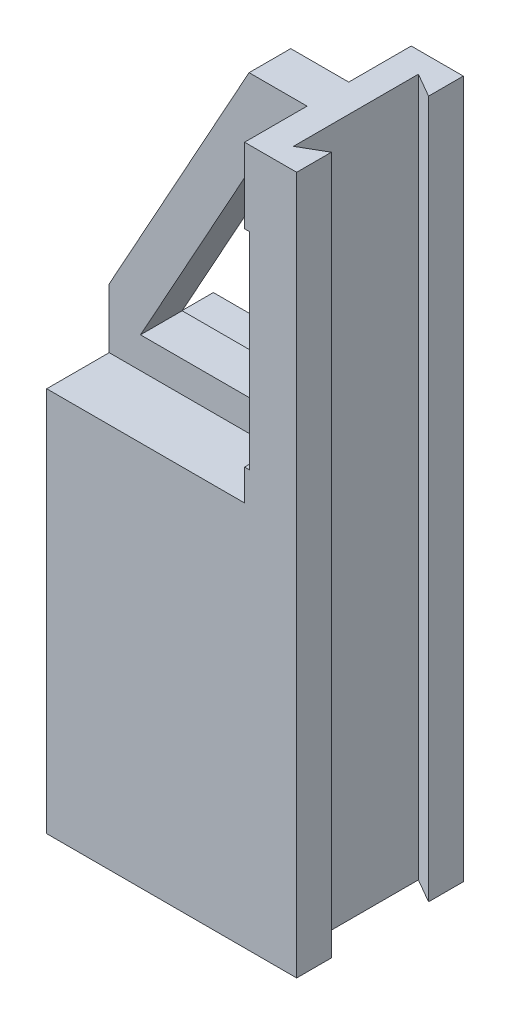
ISO-10303-21;
HEADER;
FILE_DESCRIPTION(('STEP AP214'),'2;1');
FILE_NAME('part.step','',(''),(''),'','','');
FILE_SCHEMA(('AUTOMOTIVE_DESIGN { 1 0 10303 214 1 1 1 1 }'));
ENDSEC;
DATA;
#1=APPLICATION_CONTEXT('core data for automotive mechanical design processes');
#2=APPLICATION_PROTOCOL_DEFINITION('international standard','automotive_design',2000,#1);
#3=PRODUCT_CONTEXT('',#1,'mechanical');
#4=PRODUCT('Part','Part','',(#3));
#5=PRODUCT_RELATED_PRODUCT_CATEGORY('part','',(#4));
#6=PRODUCT_DEFINITION_FORMATION('','',#4);
#7=PRODUCT_DEFINITION_CONTEXT('part definition',#1,'design');
#8=PRODUCT_DEFINITION('design','',#6,#7);
#9=PRODUCT_DEFINITION_SHAPE('','',#8);
#10=(LENGTH_UNIT() NAMED_UNIT(*) SI_UNIT(.MILLI.,.METRE.));
#11=(NAMED_UNIT(*) PLANE_ANGLE_UNIT() SI_UNIT($,.RADIAN.));
#12=(NAMED_UNIT(*) SI_UNIT($,.STERADIAN.) SOLID_ANGLE_UNIT());
#13=UNCERTAINTY_MEASURE_WITH_UNIT(LENGTH_MEASURE(1.E-05),#10,'distance_accuracy_value','');
#14=(GEOMETRIC_REPRESENTATION_CONTEXT(3) GLOBAL_UNCERTAINTY_ASSIGNED_CONTEXT((#13)) GLOBAL_UNIT_ASSIGNED_CONTEXT((#10,
#11,#12)) REPRESENTATION_CONTEXT('',''));
#15=CARTESIAN_POINT('',(0.,0.,0.));
#16=DIRECTION('',(0.,0.,1.));
#17=DIRECTION('',(1.,0.,0.));
#18=AXIS2_PLACEMENT_3D('',#15,#16,#17);
#19=CARTESIAN_POINT('',(120.,0.,80.));
#20=DIRECTION('',(-1.,0.,0.));
#21=DIRECTION('',(0.,0.,1.));
#22=AXIS2_PLACEMENT_3D('',#19,#20,#21);
#23=PLANE('',#22);
#24=DIRECTION('',(0.,0.,-1.));
#25=VECTOR('',#24,1.);
#26=CARTESIAN_POINT('',(120.,335.,80.));
#27=LINE('',#26,#25);
#28=CARTESIAN_POINT('',(120.,335.,16.6730460901802));
#29=VERTEX_POINT('',#28);
#30=CARTESIAN_POINT('',(120.,335.,0.));
#31=VERTEX_POINT('',#30);
#32=EDGE_CURVE('E342',#29,#31,#27,.T.);
#33=ORIENTED_EDGE('',*,*,#32,.F.);
#34=DIRECTION('',(0.,1.,0.));
#35=VECTOR('',#34,1.);
#36=CARTESIAN_POINT('',(120.,0.,16.6730460901802));
#37=LINE('',#36,#35);
#38=CARTESIAN_POINT('',(120.,0.,16.6730460901802));
#39=VERTEX_POINT('',#38);
#40=EDGE_CURVE('E218',#39,#29,#37,.T.);
#41=ORIENTED_EDGE('',*,*,#40,.F.);
#42=DIRECTION('',(0.,0.,-1.));
#43=VECTOR('',#42,1.);
#44=CARTESIAN_POINT('',(120.,0.,80.));
#45=LINE('',#44,#43);
#46=CARTESIAN_POINT('',(120.,0.,0.));
#47=VERTEX_POINT('',#46);
#48=EDGE_CURVE('E209',#39,#47,#45,.T.);
#49=ORIENTED_EDGE('',*,*,#48,.T.);
#50=DIRECTION('',(0.,1.,0.));
#51=VECTOR('',#50,1.);
#52=CARTESIAN_POINT('',(120.,0.,0.));
#53=LINE('',#52,#51);
#54=EDGE_CURVE('E332',#47,#31,#53,.T.);
#55=ORIENTED_EDGE('',*,*,#54,.T.);
#56=EDGE_LOOP('',(#33,#41,#49,#55));
#57=FACE_BOUND('',#56,.T.);
#58=ADVANCED_FACE('F35',(#57),#23,.F.);
#59=CARTESIAN_POINT('',(0.,0.,80.));
#60=DIRECTION('',(0.,0.,1.));
#61=DIRECTION('',(1.,0.,0.));
#62=AXIS2_PLACEMENT_3D('',#59,#60,#61);
#63=PLANE('',#62);
#64=DIRECTION('',(0.,1.,0.));
#65=VECTOR('',#64,1.);
#66=CARTESIAN_POINT('',(95.0000000000001,185.,80.));
#67=LINE('',#66,#65);
#68=CARTESIAN_POINT('',(95.0000000000001,298.978426920679,80.));
#69=VERTEX_POINT('',#68);
#70=CARTESIAN_POINT('',(95.,335.,80.));
#71=VERTEX_POINT('',#70);
#72=EDGE_CURVE('E272',#69,#71,#67,.T.);
#73=ORIENTED_EDGE('',*,*,#72,.F.);
#74=DIRECTION('',(-1.,0.,0.));
#75=VECTOR('',#74,1.);
#76=CARTESIAN_POINT('',(69.8251570739534,298.978426920679,80.));
#77=LINE('',#76,#75);
#78=CARTESIAN_POINT('',(97.3994917302005,298.978426920679,80.));
#79=VERTEX_POINT('',#78);
#80=EDGE_CURVE('E297',#79,#69,#77,.T.);
#81=ORIENTED_EDGE('',*,*,#80,.F.);
#82=DIRECTION('',(0.,1.,0.));
#83=VECTOR('',#82,1.);
#84=CARTESIAN_POINT('',(97.3994917302005,298.978426920679,80.));
#85=LINE('',#84,#83);
#86=CARTESIAN_POINT('',(97.3994917302006,199.934070046657,80.));
#87=VERTEX_POINT('',#86);
#88=EDGE_CURVE('E294',#87,#79,#85,.T.);
#89=ORIENTED_EDGE('',*,*,#88,.F.);
#90=DIRECTION('',(1.,0.,0.));
#91=VECTOR('',#90,1.);
#92=CARTESIAN_POINT('',(97.3994917302006,199.934070046657,80.));
#93=LINE('',#92,#91);
#94=CARTESIAN_POINT('',(95.0000000000001,199.934070046657,80.));
#95=VERTEX_POINT('',#94);
#96=EDGE_CURVE('E292',#95,#87,#93,.T.);
#97=ORIENTED_EDGE('',*,*,#96,.F.);
#98=CARTESIAN_POINT('',(95.0000000000001,185.,80.));
#99=VERTEX_POINT('',#98);
#100=EDGE_CURVE('E270',#99,#95,#67,.T.);
#101=ORIENTED_EDGE('',*,*,#100,.F.);
#102=DIRECTION('',(1.,0.,0.));
#103=VECTOR('',#102,1.);
#104=CARTESIAN_POINT('',(1.02039165649137E-13,185.,80.));
#105=LINE('',#104,#103);
#106=CARTESIAN_POINT('',(1.02039165649137E-13,185.,80.));
#107=VERTEX_POINT('',#106);
#108=EDGE_CURVE('E259',#107,#99,#105,.T.);
#109=ORIENTED_EDGE('',*,*,#108,.F.);
#110=DIRECTION('',(0.,-1.,0.));
#111=VECTOR('',#110,1.);
#112=CARTESIAN_POINT('',(0.,213.595360649971,80.));
#113=LINE('',#112,#111);
#114=CARTESIAN_POINT('',(0.,0.,80.));
#115=VERTEX_POINT('',#114);
#116=EDGE_CURVE('E318',#107,#115,#113,.T.);
#117=ORIENTED_EDGE('',*,*,#116,.T.);
#118=DIRECTION('',(1.,0.,0.));
#119=VECTOR('',#118,1.);
#120=CARTESIAN_POINT('',(0.,0.,80.));
#121=LINE('',#120,#119);
#122=CARTESIAN_POINT('',(120.,0.,80.));
#123=VERTEX_POINT('',#122);
#124=EDGE_CURVE('E320',#115,#123,#121,.T.);
#125=ORIENTED_EDGE('',*,*,#124,.T.);
#126=DIRECTION('',(0.,1.,0.));
#127=VECTOR('',#126,1.);
#128=CARTESIAN_POINT('',(120.,0.,80.));
#129=LINE('',#128,#127);
#130=CARTESIAN_POINT('',(120.,335.,80.));
#131=VERTEX_POINT('',#130);
#132=EDGE_CURVE('E323',#123,#131,#129,.T.);
#133=ORIENTED_EDGE('',*,*,#132,.T.);
#134=DIRECTION('',(-1.,0.,0.));
#135=VECTOR('',#134,1.);
#136=CARTESIAN_POINT('',(120.,335.,80.));
#137=LINE('',#136,#135);
#138=EDGE_CURVE('E325',#131,#71,#137,.T.);
#139=ORIENTED_EDGE('',*,*,#138,.T.);
#140=EDGE_LOOP('',(#73,#81,#89,#97,#101,#109,#117,#125,#133,#139));
#141=FACE_BOUND('',#140,.T.);
#142=ADVANCED_FACE('F365',(#141),#63,.T.);
#143=CARTESIAN_POINT('',(0.,0.,0.));
#144=DIRECTION('',(0.,0.,1.));
#145=DIRECTION('',(1.,0.,0.));
#146=AXIS2_PLACEMENT_3D('',#143,#144,#145);
#147=PLANE('',#146);
#148=DIRECTION('',(-1.,0.,0.));
#149=VECTOR('',#148,1.);
#150=CARTESIAN_POINT('',(69.8251570739534,298.978426920679,0.));
#151=LINE('',#150,#149);
#152=CARTESIAN_POINT('',(97.3994917302005,298.978426920679,0.));
#153=VERTEX_POINT('',#152);
#154=CARTESIAN_POINT('',(95.0000000000001,298.978426920679,0.));
#155=VERTEX_POINT('',#154);
#156=EDGE_CURVE('E295',#153,#155,#151,.T.);
#157=ORIENTED_EDGE('',*,*,#156,.T.);
#158=DIRECTION('',(0.,1.,0.));
#159=VECTOR('',#158,1.);
#160=CARTESIAN_POINT('',(95.0000000000001,185.,0.));
#161=LINE('',#160,#159);
#162=CARTESIAN_POINT('',(95.,335.,0.));
#163=VERTEX_POINT('',#162);
#164=EDGE_CURVE('E247',#155,#163,#161,.T.);
#165=ORIENTED_EDGE('',*,*,#164,.T.);
#166=DIRECTION('',(-1.,0.,0.));
#167=VECTOR('',#166,1.);
#168=CARTESIAN_POINT('',(120.,335.,0.));
#169=LINE('',#168,#167);
#170=EDGE_CURVE('E321',#31,#163,#169,.T.);
#171=ORIENTED_EDGE('',*,*,#170,.F.);
#172=ORIENTED_EDGE('',*,*,#54,.F.);
#173=DIRECTION('',(1.,0.,0.));
#174=VECTOR('',#173,1.);
#175=CARTESIAN_POINT('',(0.,0.,0.));
#176=LINE('',#175,#174);
#177=CARTESIAN_POINT('',(0.,0.,0.));
#178=VERTEX_POINT('',#177);
#179=EDGE_CURVE('E330',#178,#47,#176,.T.);
#180=ORIENTED_EDGE('',*,*,#179,.F.);
#181=DIRECTION('',(0.,-1.,0.));
#182=VECTOR('',#181,1.);
#183=CARTESIAN_POINT('',(0.,213.595360649971,0.));
#184=LINE('',#183,#182);
#185=CARTESIAN_POINT('',(1.02039165649137E-13,185.,0.));
#186=VERTEX_POINT('',#185);
#187=EDGE_CURVE('E317',#186,#178,#184,.T.);
#188=ORIENTED_EDGE('',*,*,#187,.F.);
#189=DIRECTION('',(-1.,0.,0.));
#190=VECTOR('',#189,1.);
#191=CARTESIAN_POINT('',(1.02039165649137E-13,185.,0.));
#192=LINE('',#191,#190);
#193=CARTESIAN_POINT('',(95.0000000000001,185.,0.));
#194=VERTEX_POINT('',#193);
#195=EDGE_CURVE('E235',#194,#186,#192,.T.);
#196=ORIENTED_EDGE('',*,*,#195,.F.);
#197=CARTESIAN_POINT('',(95.0000000000001,199.934070046657,0.));
#198=VERTEX_POINT('',#197);
#199=EDGE_CURVE('E243',#194,#198,#161,.T.);
#200=ORIENTED_EDGE('',*,*,#199,.T.);
#201=DIRECTION('',(1.,0.,0.));
#202=VECTOR('',#201,1.);
#203=CARTESIAN_POINT('',(97.3994917302006,199.934070046657,0.));
#204=LINE('',#203,#202);
#205=CARTESIAN_POINT('',(97.3994917302006,199.934070046657,0.));
#206=VERTEX_POINT('',#205);
#207=EDGE_CURVE('E291',#198,#206,#204,.T.);
#208=ORIENTED_EDGE('',*,*,#207,.T.);
#209=DIRECTION('',(0.,1.,0.));
#210=VECTOR('',#209,1.);
#211=CARTESIAN_POINT('',(97.3994917302005,298.978426920679,0.));
#212=LINE('',#211,#210);
#213=EDGE_CURVE('E302',#206,#153,#212,.T.);
#214=ORIENTED_EDGE('',*,*,#213,.T.);
#215=EDGE_LOOP('',(#157,#165,#171,#172,#180,#188,#196,#200,#208,#214));
#216=FACE_BOUND('',#215,.T.);
#217=ADVANCED_FACE('F423',(#216),#147,.F.);
#218=CARTESIAN_POINT('',(0.,213.595360649971,80.));
#219=DIRECTION('',(1.,0.,0.));
#220=DIRECTION('',(0.,0.,-1.));
#221=AXIS2_PLACEMENT_3D('',#218,#219,#220);
#222=PLANE('',#221);
#223=DIRECTION('',(0.,0.,-1.));
#224=VECTOR('',#223,1.);
#225=CARTESIAN_POINT('',(0.,213.595360649971,80.));
#226=LINE('',#225,#224);
#227=CARTESIAN_POINT('',(0.,213.595360649971,50.));
#228=VERTEX_POINT('',#227);
#229=CARTESIAN_POINT('',(0.,213.595360649971,30.));
#230=VERTEX_POINT('',#229);
#231=EDGE_CURVE('E328',#228,#230,#226,.T.);
#232=ORIENTED_EDGE('',*,*,#231,.T.);
#233=DIRECTION('',(0.,1.,0.));
#234=VECTOR('',#233,1.);
#235=CARTESIAN_POINT('',(1.02057963836372E-13,185.,30.));
#236=LINE('',#235,#234);
#237=CARTESIAN_POINT('',(1.02057963836372E-13,185.,30.));
#238=VERTEX_POINT('',#237);
#239=EDGE_CURVE('E237',#238,#230,#236,.T.);
#240=ORIENTED_EDGE('',*,*,#239,.F.);
#241=DIRECTION('',(0.,0.,1.));
#242=VECTOR('',#241,1.);
#243=CARTESIAN_POINT('',(1.02057963836372E-13,185.,30.));
#244=LINE('',#243,#242);
#245=EDGE_CURVE('E225',#186,#238,#244,.T.);
#246=ORIENTED_EDGE('',*,*,#245,.F.);
#247=ORIENTED_EDGE('',*,*,#187,.T.);
#248=DIRECTION('',(0.,0.,-1.));
#249=VECTOR('',#248,1.);
#250=CARTESIAN_POINT('',(0.,0.,80.));
#251=LINE('',#250,#249);
#252=EDGE_CURVE('E349',#115,#178,#251,.T.);
#253=ORIENTED_EDGE('',*,*,#252,.F.);
#254=ORIENTED_EDGE('',*,*,#116,.F.);
#255=DIRECTION('',(0.,0.,1.));
#256=VECTOR('',#255,1.);
#257=CARTESIAN_POINT('',(1.02057963836372E-13,185.,50.));
#258=LINE('',#257,#256);
#259=CARTESIAN_POINT('',(1.02057963836372E-13,185.,50.));
#260=VERTEX_POINT('',#259);
#261=EDGE_CURVE('E256',#260,#107,#258,.T.);
#262=ORIENTED_EDGE('',*,*,#261,.F.);
#263=DIRECTION('',(0.,1.,0.));
#264=VECTOR('',#263,1.);
#265=CARTESIAN_POINT('',(1.02057963836372E-13,185.,50.));
#266=LINE('',#265,#264);
#267=EDGE_CURVE('E264',#260,#228,#266,.T.);
#268=ORIENTED_EDGE('',*,*,#267,.T.);
#269=EDGE_LOOP('',(#232,#240,#246,#247,#253,#254,#262,#268));
#270=FACE_BOUND('',#269,.T.);
#271=ADVANCED_FACE('F37',(#270),#222,.F.);
#272=CARTESIAN_POINT('',(0.,0.,80.));
#273=DIRECTION('',(0.,1.,0.));
#274=DIRECTION('',(0.,0.,1.));
#275=AXIS2_PLACEMENT_3D('',#272,#273,#274);
#276=PLANE('',#275);
#277=ORIENTED_EDGE('',*,*,#48,.F.);
#278=DIRECTION('',(-0.866025403784441,0.,-0.499999999999995));
#279=VECTOR('',#278,1.);
#280=CARTESIAN_POINT('',(120.,0.,16.6730460901802));
#281=LINE('',#280,#279);
#282=CARTESIAN_POINT('',(108.441945130559,0.,10.));
#283=VERTEX_POINT('',#282);
#284=EDGE_CURVE('E191',#39,#283,#281,.T.);
#285=ORIENTED_EDGE('',*,*,#284,.T.);
#286=DIRECTION('',(0.,0.,1.));
#287=VECTOR('',#286,1.);
#288=CARTESIAN_POINT('',(108.441945130559,0.,10.));
#289=LINE('',#288,#287);
#290=CARTESIAN_POINT('',(108.441945130559,0.,70.));
#291=VERTEX_POINT('',#290);
#292=EDGE_CURVE('E200',#283,#291,#289,.T.);
#293=ORIENTED_EDGE('',*,*,#292,.T.);
#294=DIRECTION('',(0.866025403784438,0.,-0.500000000000001));
#295=VECTOR('',#294,1.);
#296=CARTESIAN_POINT('',(108.441945130559,0.,70.));
#297=LINE('',#296,#295);
#298=CARTESIAN_POINT('',(120.,0.,63.3269539098197));
#299=VERTEX_POINT('',#298);
#300=EDGE_CURVE('E197',#291,#299,#297,.T.);
#301=ORIENTED_EDGE('',*,*,#300,.T.);
#302=EDGE_CURVE('E346',#123,#299,#45,.T.);
#303=ORIENTED_EDGE('',*,*,#302,.F.);
#304=ORIENTED_EDGE('',*,*,#124,.F.);
#305=ORIENTED_EDGE('',*,*,#252,.T.);
#306=ORIENTED_EDGE('',*,*,#179,.T.);
#307=EDGE_LOOP('',(#277,#285,#293,#301,#303,#304,#305,#306));
#308=FACE_BOUND('',#307,.T.);
#309=ADVANCED_FACE('F207',(#308),#276,.F.);
#310=ORIENTED_EDGE('',*,*,#302,.T.);
#311=DIRECTION('',(0.,1.,0.));
#312=VECTOR('',#311,1.);
#313=CARTESIAN_POINT('',(120.,0.,63.3269539098197));
#314=LINE('',#313,#312);
#315=CARTESIAN_POINT('',(120.,335.,63.3269539098197));
#316=VERTEX_POINT('',#315);
#317=EDGE_CURVE('E221',#299,#316,#314,.T.);
#318=ORIENTED_EDGE('',*,*,#317,.T.);
#319=EDGE_CURVE('E343',#131,#316,#27,.T.);
#320=ORIENTED_EDGE('',*,*,#319,.F.);
#321=ORIENTED_EDGE('',*,*,#132,.F.);
#322=EDGE_LOOP('',(#310,#318,#320,#321));
#323=FACE_BOUND('',#322,.T.);
#324=ADVANCED_FACE('F405',(#323),#23,.F.);
#325=CARTESIAN_POINT('',(120.,335.,80.));
#326=DIRECTION('',(0.,-1.,0.));
#327=DIRECTION('',(0.,0.,-1.));
#328=AXIS2_PLACEMENT_3D('',#325,#326,#327);
#329=PLANE('',#328);
#330=DIRECTION('',(0.,0.,1.));
#331=VECTOR('',#330,1.);
#332=CARTESIAN_POINT('',(108.441945130559,335.,10.));
#333=LINE('',#332,#331);
#334=CARTESIAN_POINT('',(108.441945130559,335.,9.99999999999999));
#335=VERTEX_POINT('',#334);
#336=CARTESIAN_POINT('',(108.441945130559,335.,70.));
#337=VERTEX_POINT('',#336);
#338=EDGE_CURVE('E212',#335,#337,#333,.T.);
#339=ORIENTED_EDGE('',*,*,#338,.F.);
#340=DIRECTION('',(-0.866025403784441,0.,-0.499999999999995));
#341=VECTOR('',#340,1.);
#342=CARTESIAN_POINT('',(120.,335.,16.6730460901802));
#343=LINE('',#342,#341);
#344=EDGE_CURVE('E50',#29,#335,#343,.T.);
#345=ORIENTED_EDGE('',*,*,#344,.F.);
#346=ORIENTED_EDGE('',*,*,#32,.T.);
#347=ORIENTED_EDGE('',*,*,#170,.T.);
#348=DIRECTION('',(0.,0.,-1.));
#349=VECTOR('',#348,1.);
#350=CARTESIAN_POINT('',(95.,335.,30.));
#351=LINE('',#350,#349);
#352=CARTESIAN_POINT('',(95.,335.,30.));
#353=VERTEX_POINT('',#352);
#354=EDGE_CURVE('E229',#353,#163,#351,.T.);
#355=ORIENTED_EDGE('',*,*,#354,.F.);
#356=DIRECTION('',(1.,0.,0.));
#357=VECTOR('',#356,1.);
#358=CARTESIAN_POINT('',(0.,335.,30.));
#359=LINE('',#358,#357);
#360=CARTESIAN_POINT('',(67.160475454182,335.,30.));
#361=VERTEX_POINT('',#360);
#362=EDGE_CURVE('E238',#361,#353,#359,.T.);
#363=ORIENTED_EDGE('',*,*,#362,.F.);
#364=DIRECTION('',(0.,0.,-1.));
#365=VECTOR('',#364,1.);
#366=CARTESIAN_POINT('',(67.160475454182,335.,80.));
#367=LINE('',#366,#365);
#368=CARTESIAN_POINT('',(67.160475454182,335.,50.));
#369=VERTEX_POINT('',#368);
#370=EDGE_CURVE('E339',#369,#361,#367,.T.);
#371=ORIENTED_EDGE('',*,*,#370,.F.);
#372=DIRECTION('',(-1.,0.,0.));
#373=VECTOR('',#372,1.);
#374=CARTESIAN_POINT('',(0.,335.,50.));
#375=LINE('',#374,#373);
#376=CARTESIAN_POINT('',(95.,335.,50.));
#377=VERTEX_POINT('',#376);
#378=EDGE_CURVE('E220',#377,#369,#375,.T.);
#379=ORIENTED_EDGE('',*,*,#378,.F.);
#380=DIRECTION('',(0.,0.,-1.));
#381=VECTOR('',#380,1.);
#382=CARTESIAN_POINT('',(95.,335.,50.));
#383=LINE('',#382,#381);
#384=EDGE_CURVE('E257',#71,#377,#383,.T.);
#385=ORIENTED_EDGE('',*,*,#384,.F.);
#386=ORIENTED_EDGE('',*,*,#138,.F.);
#387=ORIENTED_EDGE('',*,*,#319,.T.);
#388=DIRECTION('',(0.866025403784438,0.,-0.500000000000001));
#389=VECTOR('',#388,1.);
#390=CARTESIAN_POINT('',(108.441945130559,335.,70.));
#391=LINE('',#390,#389);
#392=EDGE_CURVE('E210',#337,#316,#391,.T.);
#393=ORIENTED_EDGE('',*,*,#392,.F.);
#394=EDGE_LOOP('',(#339,#345,#346,#347,#355,#363,#371,#379,#385,#386,#387,#393));
#395=FACE_BOUND('',#394,.T.);
#396=ADVANCED_FACE('F408',(#395),#329,.F.);
#397=CARTESIAN_POINT('',(67.160475454182,335.,80.));
#398=DIRECTION('',(0.875032631367901,-0.484063935902446,0.));
#399=DIRECTION('',(0.484063935902446,0.875032631367901,0.));
#400=AXIS2_PLACEMENT_3D('',#397,#398,#399);
#401=PLANE('',#400);
#402=ORIENTED_EDGE('',*,*,#370,.T.);
#403=DIRECTION('',(-0.484063935902446,-0.875032631367901,0.));
#404=VECTOR('',#403,1.);
#405=CARTESIAN_POINT('',(67.160475454182,335.,30.));
#406=LINE('',#405,#404);
#407=EDGE_CURVE('E284',#361,#230,#406,.T.);
#408=ORIENTED_EDGE('',*,*,#407,.T.);
#409=ORIENTED_EDGE('',*,*,#231,.F.);
#410=DIRECTION('',(0.484063935902446,0.875032631367901,0.));
#411=VECTOR('',#410,1.);
#412=CARTESIAN_POINT('',(67.160475454182,335.,50.));
#413=LINE('',#412,#411);
#414=EDGE_CURVE('E277',#228,#369,#413,.T.);
#415=ORIENTED_EDGE('',*,*,#414,.T.);
#416=EDGE_LOOP('',(#402,#408,#409,#415));
#417=FACE_BOUND('',#416,.T.);
#418=ADVANCED_FACE('F414',(#417),#401,.F.);
#419=CARTESIAN_POINT('',(97.3994917302006,199.934070046657,80.));
#420=DIRECTION('',(0.,1.,0.));
#421=DIRECTION('',(0.,0.,1.));
#422=AXIS2_PLACEMENT_3D('',#419,#420,#421);
#423=PLANE('',#422);
#424=DIRECTION('',(0.,0.,-1.));
#425=VECTOR('',#424,1.);
#426=CARTESIAN_POINT('',(95.0000000000001,199.934070046657,80.));
#427=LINE('',#426,#425);
#428=CARTESIAN_POINT('',(95.0000000000001,199.934070046657,30.));
#429=VERTEX_POINT('',#428);
#430=EDGE_CURVE('E289',#429,#198,#427,.T.);
#431=ORIENTED_EDGE('',*,*,#430,.F.);
#432=DIRECTION('',(1.,0.,0.));
#433=VECTOR('',#432,1.);
#434=CARTESIAN_POINT('',(97.3994917302006,199.934070046657,30.));
#435=LINE('',#434,#433);
#436=CARTESIAN_POINT('',(15.0342847125226,199.934070046657,30.));
#437=VERTEX_POINT('',#436);
#438=EDGE_CURVE('E282',#437,#429,#435,.T.);
#439=ORIENTED_EDGE('',*,*,#438,.F.);
#440=DIRECTION('',(0.,0.,-1.));
#441=VECTOR('',#440,1.);
#442=CARTESIAN_POINT('',(15.0342847125226,199.934070046657,80.));
#443=LINE('',#442,#441);
#444=CARTESIAN_POINT('',(15.0342847125226,199.934070046657,50.));
#445=VERTEX_POINT('',#444);
#446=EDGE_CURVE('E300',#445,#437,#443,.T.);
#447=ORIENTED_EDGE('',*,*,#446,.F.);
#448=DIRECTION('',(-1.,0.,0.));
#449=VECTOR('',#448,1.);
#450=CARTESIAN_POINT('',(97.3994917302006,199.934070046657,50.));
#451=LINE('',#450,#449);
#452=CARTESIAN_POINT('',(95.0000000000001,199.934070046657,50.));
#453=VERTEX_POINT('',#452);
#454=EDGE_CURVE('E58',#453,#445,#451,.T.);
#455=ORIENTED_EDGE('',*,*,#454,.F.);
#456=DIRECTION('',(0.,0.,-1.));
#457=VECTOR('',#456,1.);
#458=CARTESIAN_POINT('',(95.0000000000001,199.934070046657,80.));
#459=LINE('',#458,#457);
#460=EDGE_CURVE('E287',#95,#453,#459,.T.);
#461=ORIENTED_EDGE('',*,*,#460,.F.);
#462=ORIENTED_EDGE('',*,*,#96,.T.);
#463=DIRECTION('',(0.,0.,-1.));
#464=VECTOR('',#463,1.);
#465=CARTESIAN_POINT('',(97.3994917302006,199.934070046657,80.));
#466=LINE('',#465,#464);
#467=EDGE_CURVE('E314',#87,#206,#466,.T.);
#468=ORIENTED_EDGE('',*,*,#467,.T.);
#469=ORIENTED_EDGE('',*,*,#207,.F.);
#470=EDGE_LOOP('',(#431,#439,#447,#455,#461,#462,#468,#469));
#471=FACE_BOUND('',#470,.T.);
#472=ADVANCED_FACE('F382',(#471),#423,.T.);
#473=CARTESIAN_POINT('',(97.3994917302005,298.978426920679,80.));
#474=DIRECTION('',(-1.,0.,0.));
#475=DIRECTION('',(0.,-1.,0.));
#476=AXIS2_PLACEMENT_3D('',#473,#474,#475);
#477=PLANE('',#476);
#478=ORIENTED_EDGE('',*,*,#213,.F.);
#479=ORIENTED_EDGE('',*,*,#467,.F.);
#480=ORIENTED_EDGE('',*,*,#88,.T.);
#481=DIRECTION('',(0.,0.,-1.));
#482=VECTOR('',#481,1.);
#483=CARTESIAN_POINT('',(97.3994917302005,298.978426920679,80.));
#484=LINE('',#483,#482);
#485=EDGE_CURVE('E312',#79,#153,#484,.T.);
#486=ORIENTED_EDGE('',*,*,#485,.T.);
#487=EDGE_LOOP('',(#478,#479,#480,#486));
#488=FACE_BOUND('',#487,.T.);
#489=ADVANCED_FACE('F374',(#488),#477,.T.);
#490=CARTESIAN_POINT('',(69.8251570739534,298.978426920679,80.));
#491=DIRECTION('',(0.,-1.,0.));
#492=DIRECTION('',(0.,0.,-1.));
#493=AXIS2_PLACEMENT_3D('',#490,#491,#492);
#494=PLANE('',#493);
#495=DIRECTION('',(0.,0.,1.));
#496=VECTOR('',#495,1.);
#497=CARTESIAN_POINT('',(95.0000000000001,298.978426920679,80.));
#498=LINE('',#497,#496);
#499=CARTESIAN_POINT('',(95.0000000000001,298.978426920679,30.));
#500=VERTEX_POINT('',#499);
#501=EDGE_CURVE('E11',#155,#500,#498,.T.);
#502=ORIENTED_EDGE('',*,*,#501,.F.);
#503=ORIENTED_EDGE('',*,*,#156,.F.);
#504=ORIENTED_EDGE('',*,*,#485,.F.);
#505=ORIENTED_EDGE('',*,*,#80,.T.);
#506=DIRECTION('',(0.,0.,1.));
#507=VECTOR('',#506,1.);
#508=CARTESIAN_POINT('',(95.0000000000001,298.978426920679,80.));
#509=LINE('',#508,#507);
#510=CARTESIAN_POINT('',(95.0000000000001,298.978426920679,50.));
#511=VERTEX_POINT('',#510);
#512=EDGE_CURVE('E43',#511,#69,#509,.T.);
#513=ORIENTED_EDGE('',*,*,#512,.F.);
#514=DIRECTION('',(1.,0.,0.));
#515=VECTOR('',#514,1.);
#516=CARTESIAN_POINT('',(69.8251570739534,298.978426920679,50.));
#517=LINE('',#516,#515);
#518=CARTESIAN_POINT('',(69.8251570739534,298.978426920679,50.));
#519=VERTEX_POINT('',#518);
#520=EDGE_CURVE('E246',#519,#511,#517,.T.);
#521=ORIENTED_EDGE('',*,*,#520,.F.);
#522=DIRECTION('',(0.,0.,-1.));
#523=VECTOR('',#522,1.);
#524=CARTESIAN_POINT('',(69.8251570739534,298.978426920679,80.));
#525=LINE('',#524,#523);
#526=CARTESIAN_POINT('',(69.8251570739534,298.978426920679,30.));
#527=VERTEX_POINT('',#526);
#528=EDGE_CURVE('E309',#519,#527,#525,.T.);
#529=ORIENTED_EDGE('',*,*,#528,.T.);
#530=DIRECTION('',(-1.,0.,0.));
#531=VECTOR('',#530,1.);
#532=CARTESIAN_POINT('',(69.8251570739534,298.978426920679,30.));
#533=LINE('',#532,#531);
#534=EDGE_CURVE('E280',#500,#527,#533,.T.);
#535=ORIENTED_EDGE('',*,*,#534,.F.);
#536=EDGE_LOOP('',(#502,#503,#504,#505,#513,#521,#529,#535));
#537=FACE_BOUND('',#536,.T.);
#538=ADVANCED_FACE('F370',(#537),#494,.T.);
#539=CARTESIAN_POINT('',(15.0342847125226,199.934070046657,80.));
#540=DIRECTION('',(0.875032631367901,-0.484063935902446,0.));
#541=DIRECTION('',(0.484063935902446,0.875032631367901,0.));
#542=AXIS2_PLACEMENT_3D('',#539,#540,#541);
#543=PLANE('',#542);
#544=DIRECTION('',(-0.484063935902446,-0.875032631367901,0.));
#545=VECTOR('',#544,1.);
#546=CARTESIAN_POINT('',(15.0342847125226,199.934070046657,30.));
#547=LINE('',#546,#545);
#548=EDGE_CURVE('E354',#527,#437,#547,.T.);
#549=ORIENTED_EDGE('',*,*,#548,.F.);
#550=ORIENTED_EDGE('',*,*,#528,.F.);
#551=DIRECTION('',(0.484063935902446,0.875032631367901,0.));
#552=VECTOR('',#551,1.);
#553=CARTESIAN_POINT('',(15.0342847125226,199.934070046657,50.));
#554=LINE('',#553,#552);
#555=EDGE_CURVE('E352',#445,#519,#554,.T.);
#556=ORIENTED_EDGE('',*,*,#555,.F.);
#557=ORIENTED_EDGE('',*,*,#446,.T.);
#558=EDGE_LOOP('',(#549,#550,#556,#557));
#559=FACE_BOUND('',#558,.T.);
#560=ADVANCED_FACE('F472',(#559),#543,.T.);
#561=CARTESIAN_POINT('',(95.0000000000001,185.,50.));
#562=DIRECTION('',(1.,0.,0.));
#563=DIRECTION('',(0.,1.,0.));
#564=AXIS2_PLACEMENT_3D('',#561,#562,#563);
#565=PLANE('',#564);
#566=ORIENTED_EDGE('',*,*,#460,.T.);
#567=DIRECTION('',(0.,1.,0.));
#568=VECTOR('',#567,1.);
#569=CARTESIAN_POINT('',(95.0000000000001,185.,50.));
#570=LINE('',#569,#568);
#571=CARTESIAN_POINT('',(95.0000000000001,185.,50.));
#572=VERTEX_POINT('',#571);
#573=EDGE_CURVE('E241',#572,#453,#570,.T.);
#574=ORIENTED_EDGE('',*,*,#573,.F.);
#575=DIRECTION('',(0.,0.,-1.));
#576=VECTOR('',#575,1.);
#577=CARTESIAN_POINT('',(95.0000000000001,185.,50.));
#578=LINE('',#577,#576);
#579=EDGE_CURVE('E261',#99,#572,#578,.T.);
#580=ORIENTED_EDGE('',*,*,#579,.F.);
#581=ORIENTED_EDGE('',*,*,#100,.T.);
#582=EDGE_LOOP('',(#566,#574,#580,#581));
#583=FACE_BOUND('',#582,.T.);
#584=ADVANCED_FACE('F386',(#583),#565,.F.);
#585=CARTESIAN_POINT('',(1.02057963836372E-13,185.,50.));
#586=DIRECTION('',(0.,0.,-1.));
#587=DIRECTION('',(-1.,0.,0.));
#588=AXIS2_PLACEMENT_3D('',#585,#586,#587);
#589=PLANE('',#588);
#590=ORIENTED_EDGE('',*,*,#267,.F.);
#591=DIRECTION('',(-1.,0.,0.));
#592=VECTOR('',#591,1.);
#593=CARTESIAN_POINT('',(1.02057963836372E-13,185.,50.));
#594=LINE('',#593,#592);
#595=EDGE_CURVE('E253',#572,#260,#594,.T.);
#596=ORIENTED_EDGE('',*,*,#595,.F.);
#597=ORIENTED_EDGE('',*,*,#573,.T.);
#598=ORIENTED_EDGE('',*,*,#454,.T.);
#599=ORIENTED_EDGE('',*,*,#555,.T.);
#600=ORIENTED_EDGE('',*,*,#520,.T.);
#601=EDGE_CURVE('E269',#511,#377,#570,.T.);
#602=ORIENTED_EDGE('',*,*,#601,.T.);
#603=ORIENTED_EDGE('',*,*,#378,.T.);
#604=ORIENTED_EDGE('',*,*,#414,.F.);
#605=EDGE_LOOP('',(#590,#596,#597,#598,#599,#600,#602,#603,#604));
#606=FACE_BOUND('',#605,.T.);
#607=ADVANCED_FACE('F389',(#606),#589,.F.);
#608=ORIENTED_EDGE('',*,*,#512,.T.);
#609=ORIENTED_EDGE('',*,*,#72,.T.);
#610=ORIENTED_EDGE('',*,*,#384,.T.);
#611=ORIENTED_EDGE('',*,*,#601,.F.);
#612=EDGE_LOOP('',(#608,#609,#610,#611));
#613=FACE_BOUND('',#612,.T.);
#614=ADVANCED_FACE('F359',(#613),#565,.F.);
#615=CARTESIAN_POINT('',(-1.31874599900999E-13,185.,0.));
#616=DIRECTION('',(0.,-1.,0.));
#617=DIRECTION('',(1.,0.,0.));
#618=AXIS2_PLACEMENT_3D('',#615,#616,#617);
#619=PLANE('',#618);
#620=ORIENTED_EDGE('',*,*,#595,.T.);
#621=ORIENTED_EDGE('',*,*,#261,.T.);
#622=ORIENTED_EDGE('',*,*,#108,.T.);
#623=ORIENTED_EDGE('',*,*,#579,.T.);
#624=EDGE_LOOP('',(#620,#621,#622,#623));
#625=FACE_BOUND('',#624,.T.);
#626=ADVANCED_FACE('F392',(#625),#619,.F.);
#627=CARTESIAN_POINT('',(95.0000000000001,185.,30.));
#628=DIRECTION('',(1.,0.,0.));
#629=DIRECTION('',(0.,1.,0.));
#630=AXIS2_PLACEMENT_3D('',#627,#628,#629);
#631=PLANE('',#630);
#632=ORIENTED_EDGE('',*,*,#430,.T.);
#633=ORIENTED_EDGE('',*,*,#199,.F.);
#634=DIRECTION('',(0.,0.,-1.));
#635=VECTOR('',#634,1.);
#636=CARTESIAN_POINT('',(95.0000000000001,185.,30.));
#637=LINE('',#636,#635);
#638=CARTESIAN_POINT('',(95.0000000000001,185.,30.));
#639=VERTEX_POINT('',#638);
#640=EDGE_CURVE('E232',#639,#194,#637,.T.);
#641=ORIENTED_EDGE('',*,*,#640,.F.);
#642=DIRECTION('',(0.,1.,0.));
#643=VECTOR('',#642,1.);
#644=CARTESIAN_POINT('',(95.0000000000001,185.,30.));
#645=LINE('',#644,#643);
#646=EDGE_CURVE('E248',#639,#429,#645,.T.);
#647=ORIENTED_EDGE('',*,*,#646,.T.);
#648=EDGE_LOOP('',(#632,#633,#641,#647));
#649=FACE_BOUND('',#648,.T.);
#650=ADVANCED_FACE('F482',(#649),#631,.F.);
#651=CARTESIAN_POINT('',(1.02057963836372E-13,185.,30.));
#652=DIRECTION('',(0.,0.,1.));
#653=DIRECTION('',(1.,0.,0.));
#654=AXIS2_PLACEMENT_3D('',#651,#652,#653);
#655=PLANE('',#654);
#656=ORIENTED_EDGE('',*,*,#362,.T.);
#657=EDGE_CURVE('E251',#500,#353,#645,.T.);
#658=ORIENTED_EDGE('',*,*,#657,.F.);
#659=ORIENTED_EDGE('',*,*,#534,.T.);
#660=ORIENTED_EDGE('',*,*,#548,.T.);
#661=ORIENTED_EDGE('',*,*,#438,.T.);
#662=ORIENTED_EDGE('',*,*,#646,.F.);
#663=DIRECTION('',(1.,0.,0.));
#664=VECTOR('',#663,1.);
#665=CARTESIAN_POINT('',(1.02057963836372E-13,185.,30.));
#666=LINE('',#665,#664);
#667=EDGE_CURVE('E228',#238,#639,#666,.T.);
#668=ORIENTED_EDGE('',*,*,#667,.F.);
#669=ORIENTED_EDGE('',*,*,#239,.T.);
#670=ORIENTED_EDGE('',*,*,#407,.F.);
#671=EDGE_LOOP('',(#656,#658,#659,#660,#661,#662,#668,#669,#670));
#672=FACE_BOUND('',#671,.T.);
#673=ADVANCED_FACE('F417',(#672),#655,.F.);
#674=ORIENTED_EDGE('',*,*,#501,.T.);
#675=ORIENTED_EDGE('',*,*,#657,.T.);
#676=ORIENTED_EDGE('',*,*,#354,.T.);
#677=ORIENTED_EDGE('',*,*,#164,.F.);
#678=EDGE_LOOP('',(#674,#675,#676,#677));
#679=FACE_BOUND('',#678,.T.);
#680=ADVANCED_FACE('F485',(#679),#631,.F.);
#681=CARTESIAN_POINT('',(-1.31874599900999E-13,185.,0.));
#682=DIRECTION('',(0.,-1.,0.));
#683=DIRECTION('',(1.,0.,0.));
#684=AXIS2_PLACEMENT_3D('',#681,#682,#683);
#685=PLANE('',#684);
#686=ORIENTED_EDGE('',*,*,#245,.T.);
#687=ORIENTED_EDGE('',*,*,#667,.T.);
#688=ORIENTED_EDGE('',*,*,#640,.T.);
#689=ORIENTED_EDGE('',*,*,#195,.T.);
#690=EDGE_LOOP('',(#686,#687,#688,#689));
#691=FACE_BOUND('',#690,.T.);
#692=ADVANCED_FACE('F420',(#691),#685,.F.);
#693=CARTESIAN_POINT('',(120.,0.,16.6730460901802));
#694=DIRECTION('',(0.499999999999995,0.,-0.866025403784441));
#695=DIRECTION('',(-0.866025403784441,0.,-0.499999999999995));
#696=AXIS2_PLACEMENT_3D('',#693,#694,#695);
#697=PLANE('',#696);
#698=ORIENTED_EDGE('',*,*,#344,.T.);
#699=DIRECTION('',(0.,1.,0.));
#700=VECTOR('',#699,1.);
#701=CARTESIAN_POINT('',(108.441945130559,0.,10.));
#702=LINE('',#701,#700);
#703=EDGE_CURVE('E187',#283,#335,#702,.T.);
#704=ORIENTED_EDGE('',*,*,#703,.F.);
#705=ORIENTED_EDGE('',*,*,#284,.F.);
#706=ORIENTED_EDGE('',*,*,#40,.T.);
#707=EDGE_LOOP('',(#698,#704,#705,#706));
#708=FACE_BOUND('',#707,.T.);
#709=ADVANCED_FACE('F189',(#708),#697,.F.);
#710=CARTESIAN_POINT('',(108.441945130559,0.,70.));
#711=DIRECTION('',(0.500000000000001,0.,0.866025403784438));
#712=DIRECTION('',(0.866025403784438,0.,-0.500000000000001));
#713=AXIS2_PLACEMENT_3D('',#710,#711,#712);
#714=PLANE('',#713);
#715=ORIENTED_EDGE('',*,*,#392,.T.);
#716=ORIENTED_EDGE('',*,*,#317,.F.);
#717=ORIENTED_EDGE('',*,*,#300,.F.);
#718=DIRECTION('',(0.,1.,0.));
#719=VECTOR('',#718,1.);
#720=CARTESIAN_POINT('',(108.441945130559,0.,70.));
#721=LINE('',#720,#719);
#722=EDGE_CURVE('E196',#291,#337,#721,.T.);
#723=ORIENTED_EDGE('',*,*,#722,.T.);
#724=EDGE_LOOP('',(#715,#716,#717,#723));
#725=FACE_BOUND('',#724,.T.);
#726=ADVANCED_FACE('F429',(#725),#714,.F.);
#727=CARTESIAN_POINT('',(108.441945130559,0.,10.));
#728=DIRECTION('',(-1.,0.,0.));
#729=DIRECTION('',(0.,-1.,0.));
#730=AXIS2_PLACEMENT_3D('',#727,#728,#729);
#731=PLANE('',#730);
#732=ORIENTED_EDGE('',*,*,#338,.T.);
#733=ORIENTED_EDGE('',*,*,#722,.F.);
#734=ORIENTED_EDGE('',*,*,#292,.F.);
#735=ORIENTED_EDGE('',*,*,#703,.T.);
#736=EDGE_LOOP('',(#732,#733,#734,#735));
#737=FACE_BOUND('',#736,.T.);
#738=ADVANCED_FACE('F201',(#737),#731,.F.);
#739=CLOSED_SHELL('',(#58,#142,#217,#271,#309,#324,#396,#418,#472,#489,#538,#560,#584,#607,#614,
#626,#650,#673,#680,#692,#709,#726,#738));
#740=MANIFOLD_SOLID_BREP('B2',#739);
#741=ADVANCED_BREP_SHAPE_REPRESENTATION('',(#18,#740),#14);
#742=SHAPE_DEFINITION_REPRESENTATION(#9,#741);
ENDSEC;
END-ISO-10303-21;
